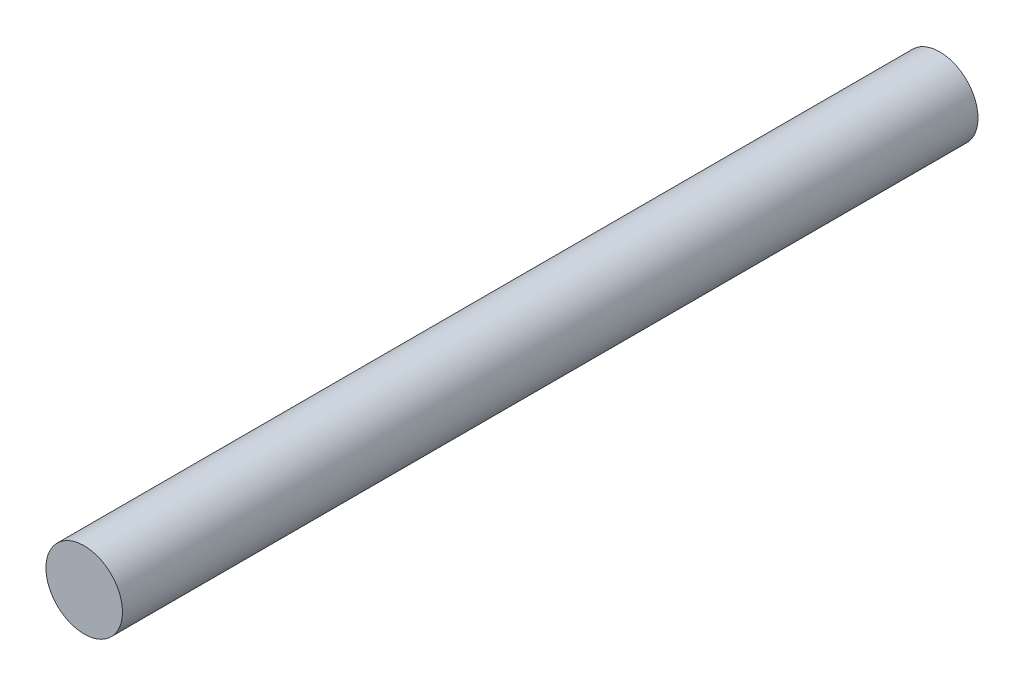
ISO-10303-21;
HEADER;
FILE_DESCRIPTION(('STEP AP214'),'2;1');
FILE_NAME('part.step','',(''),(''),'','','');
FILE_SCHEMA(('AUTOMOTIVE_DESIGN { 1 0 10303 214 1 1 1 1 }'));
ENDSEC;
DATA;
#1=APPLICATION_CONTEXT('core data for automotive mechanical design processes');
#2=APPLICATION_PROTOCOL_DEFINITION('international standard','automotive_design',2000,#1);
#3=PRODUCT_CONTEXT('',#1,'mechanical');
#4=PRODUCT('Part','Part','',(#3));
#5=PRODUCT_RELATED_PRODUCT_CATEGORY('part','',(#4));
#6=PRODUCT_DEFINITION_FORMATION('','',#4);
#7=PRODUCT_DEFINITION_CONTEXT('part definition',#1,'design');
#8=PRODUCT_DEFINITION('design','',#6,#7);
#9=PRODUCT_DEFINITION_SHAPE('','',#8);
#10=(LENGTH_UNIT() NAMED_UNIT(*) SI_UNIT(.MILLI.,.METRE.));
#11=(NAMED_UNIT(*) PLANE_ANGLE_UNIT() SI_UNIT($,.RADIAN.));
#12=(NAMED_UNIT(*) SI_UNIT($,.STERADIAN.) SOLID_ANGLE_UNIT());
#13=UNCERTAINTY_MEASURE_WITH_UNIT(LENGTH_MEASURE(1.E-05),#10,'distance_accuracy_value','');
#14=(GEOMETRIC_REPRESENTATION_CONTEXT(3) GLOBAL_UNCERTAINTY_ASSIGNED_CONTEXT((#13)) GLOBAL_UNIT_ASSIGNED_CONTEXT((#10,
#11,#12)) REPRESENTATION_CONTEXT('',''));
#15=CARTESIAN_POINT('',(0.,0.,0.));
#16=DIRECTION('',(0.,0.,1.));
#17=DIRECTION('',(1.,0.,0.));
#18=AXIS2_PLACEMENT_3D('',#15,#16,#17);
#19=CARTESIAN_POINT('',(0.,0.,140.));
#20=DIRECTION('',(0.,0.,-1.));
#21=DIRECTION('',(-1.,0.,0.));
#22=AXIS2_PLACEMENT_3D('',#19,#20,#21);
#23=CYLINDRICAL_SURFACE('',#22,6.260668565);
#24=CARTESIAN_POINT('',(0.,0.,140.));
#25=DIRECTION('',(0.,0.,1.));
#26=DIRECTION('',(1.,0.,0.));
#27=AXIS2_PLACEMENT_3D('',#24,#25,#26);
#28=CIRCLE('',#27,6.260668565);
#29=CARTESIAN_POINT('',(6.260668565,0.,140.));
#30=VERTEX_POINT('',#29);
#31=EDGE_CURVE('E10',#30,#30,#28,.T.);
#32=ORIENTED_EDGE('',*,*,#31,.F.);
#33=EDGE_LOOP('',(#32));
#34=FACE_BOUND('',#33,.T.);
#35=CARTESIAN_POINT('',(0.,0.,0.));
#36=DIRECTION('',(0.,0.,1.));
#37=DIRECTION('',(1.,0.,0.));
#38=AXIS2_PLACEMENT_3D('',#35,#36,#37);
#39=CIRCLE('',#38,6.260668565);
#40=CARTESIAN_POINT('',(6.260668565,0.,0.));
#41=VERTEX_POINT('',#40);
#42=EDGE_CURVE('E36',#41,#41,#39,.T.);
#43=ORIENTED_EDGE('',*,*,#42,.T.);
#44=EDGE_LOOP('',(#43));
#45=FACE_BOUND('',#44,.T.);
#46=ADVANCED_FACE('F33',(#34,#45),#23,.T.);
#47=CARTESIAN_POINT('',(0.,0.,140.));
#48=DIRECTION('',(0.,0.,1.));
#49=DIRECTION('',(1.,0.,0.));
#50=AXIS2_PLACEMENT_3D('',#47,#48,#49);
#51=PLANE('',#50);
#52=ORIENTED_EDGE('',*,*,#31,.T.);
#53=EDGE_LOOP('',(#52));
#54=FACE_BOUND('',#53,.T.);
#55=ADVANCED_FACE('F48',(#54),#51,.T.);
#56=CARTESIAN_POINT('',(0.,0.,0.));
#57=DIRECTION('',(0.,0.,1.));
#58=DIRECTION('',(1.,0.,0.));
#59=AXIS2_PLACEMENT_3D('',#56,#57,#58);
#60=PLANE('',#59);
#61=ORIENTED_EDGE('',*,*,#42,.F.);
#62=EDGE_LOOP('',(#61));
#63=FACE_BOUND('',#62,.T.);
#64=ADVANCED_FACE('F46',(#63),#60,.F.);
#65=CLOSED_SHELL('',(#46,#55,#64));
#66=MANIFOLD_SOLID_BREP('B2',#65);
#67=ADVANCED_BREP_SHAPE_REPRESENTATION('',(#18,#66),#14);
#68=SHAPE_DEFINITION_REPRESENTATION(#9,#67);
ENDSEC;
END-ISO-10303-21;
